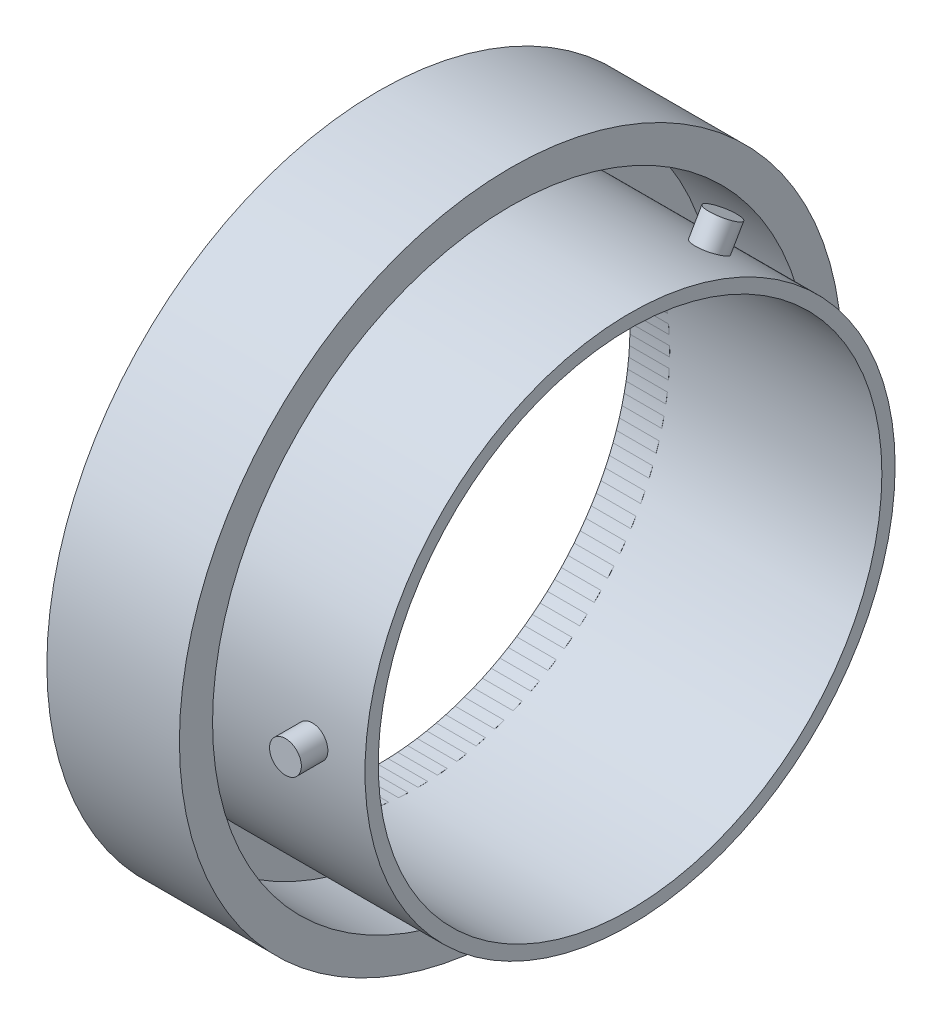
ISO-10303-21;
HEADER;
FILE_DESCRIPTION(('STEP AP214'),'2;1');
FILE_NAME('part.step','',(''),(''),'','','');
FILE_SCHEMA(('AUTOMOTIVE_DESIGN { 1 0 10303 214 1 1 1 1 }'));
ENDSEC;
DATA;
#1=APPLICATION_CONTEXT('core data for automotive mechanical design processes');
#2=APPLICATION_PROTOCOL_DEFINITION('international standard','automotive_design',2000,#1);
#3=PRODUCT_CONTEXT('',#1,'mechanical');
#4=PRODUCT('Part','Part','',(#3));
#5=PRODUCT_RELATED_PRODUCT_CATEGORY('part','',(#4));
#6=PRODUCT_DEFINITION_FORMATION('','',#4);
#7=PRODUCT_DEFINITION_CONTEXT('part definition',#1,'design');
#8=PRODUCT_DEFINITION('design','',#6,#7);
#9=PRODUCT_DEFINITION_SHAPE('','',#8);
#10=(LENGTH_UNIT() NAMED_UNIT(*) SI_UNIT(.MILLI.,.METRE.));
#11=(NAMED_UNIT(*) PLANE_ANGLE_UNIT() SI_UNIT($,.RADIAN.));
#12=(NAMED_UNIT(*) SI_UNIT($,.STERADIAN.) SOLID_ANGLE_UNIT());
#13=UNCERTAINTY_MEASURE_WITH_UNIT(LENGTH_MEASURE(1.E-05),#10,'distance_accuracy_value','');
#14=(GEOMETRIC_REPRESENTATION_CONTEXT(3) GLOBAL_UNCERTAINTY_ASSIGNED_CONTEXT((#13)) GLOBAL_UNIT_ASSIGNED_CONTEXT((#10,
#11,#12)) REPRESENTATION_CONTEXT('',''));
#15=CARTESIAN_POINT('',(0.,0.,0.));
#16=DIRECTION('',(0.,0.,1.));
#17=DIRECTION('',(1.,0.,0.));
#18=AXIS2_PLACEMENT_3D('',#15,#16,#17);
#19=CARTESIAN_POINT('',(20.,0.,0.));
#20=DIRECTION('',(-1.,0.,0.));
#21=DIRECTION('',(0.,0.,1.));
#22=AXIS2_PLACEMENT_3D('',#19,#20,#21);
#23=CYLINDRICAL_SURFACE('',#22,45.);
#24=CARTESIAN_POINT('',(20.,0.,0.));
#25=DIRECTION('',(-1.,0.,0.));
#26=DIRECTION('',(0.,0.,1.));
#27=AXIS2_PLACEMENT_3D('',#24,#25,#26);
#28=CIRCLE('',#27,45.);
#29=CARTESIAN_POINT('',(20.,0.,45.));
#30=VERTEX_POINT('',#29);
#31=EDGE_CURVE('E52',#30,#30,#28,.T.);
#32=ORIENTED_EDGE('',*,*,#31,.F.);
#33=EDGE_LOOP('',(#32));
#34=FACE_BOUND('',#33,.T.);
#35=CARTESIAN_POINT('',(5.99999999999997,0.,0.));
#36=DIRECTION('',(-1.,0.,0.));
#37=DIRECTION('',(0.,0.,1.));
#38=AXIS2_PLACEMENT_3D('',#35,#36,#37);
#39=CIRCLE('',#38,45.);
#40=CARTESIAN_POINT('',(5.99999999999997,0.,45.));
#41=VERTEX_POINT('',#40);
#42=EDGE_CURVE('E11',#41,#41,#39,.F.);
#43=ORIENTED_EDGE('',*,*,#42,.F.);
#44=EDGE_LOOP('',(#43));
#45=FACE_BOUND('',#44,.T.);
#46=ADVANCED_FACE('F42',(#34,#45),#23,.F.);
#47=CARTESIAN_POINT('',(20.,0.,0.));
#48=DIRECTION('',(-1.,0.,0.));
#49=DIRECTION('',(0.,0.,1.));
#50=AXIS2_PLACEMENT_3D('',#47,#48,#49);
#51=CYLINDRICAL_SURFACE('',#50,50.);
#52=CARTESIAN_POINT('',(20.,0.,0.));
#53=DIRECTION('',(-1.,0.,0.));
#54=DIRECTION('',(0.,0.,1.));
#55=AXIS2_PLACEMENT_3D('',#52,#53,#54);
#56=CIRCLE('',#55,50.);
#57=CARTESIAN_POINT('',(20.,0.,50.));
#58=VERTEX_POINT('',#57);
#59=EDGE_CURVE('E48',#58,#58,#56,.T.);
#60=ORIENTED_EDGE('',*,*,#59,.T.);
#61=EDGE_LOOP('',(#60));
#62=FACE_BOUND('',#61,.T.);
#63=CARTESIAN_POINT('',(0.,0.,0.));
#64=DIRECTION('',(-1.,0.,0.));
#65=DIRECTION('',(0.,0.,1.));
#66=AXIS2_PLACEMENT_3D('',#63,#64,#65);
#67=CIRCLE('',#66,50.);
#68=CARTESIAN_POINT('',(0.,0.,50.));
#69=VERTEX_POINT('',#68);
#70=EDGE_CURVE('E57',#69,#69,#67,.T.);
#71=ORIENTED_EDGE('',*,*,#70,.F.);
#72=EDGE_LOOP('',(#71));
#73=FACE_BOUND('',#72,.T.);
#74=ADVANCED_FACE('F87',(#62,#73),#51,.T.);
#75=CARTESIAN_POINT('',(20.,0.,0.));
#76=DIRECTION('',(-1.,0.,0.));
#77=DIRECTION('',(0.,0.,1.));
#78=AXIS2_PLACEMENT_3D('',#75,#76,#77);
#79=PLANE('',#78);
#80=ORIENTED_EDGE('',*,*,#31,.T.);
#81=EDGE_LOOP('',(#80));
#82=FACE_BOUND('',#81,.T.);
#83=ORIENTED_EDGE('',*,*,#59,.F.);
#84=EDGE_LOOP('',(#83));
#85=FACE_BOUND('',#84,.T.);
#86=ADVANCED_FACE('F83',(#82,#85),#79,.F.);
#87=CARTESIAN_POINT('',(0.,0.,0.));
#88=DIRECTION('',(-1.,0.,0.));
#89=DIRECTION('',(0.,0.,1.));
#90=AXIS2_PLACEMENT_3D('',#87,#88,#89);
#91=PLANE('',#90);
#92=ORIENTED_EDGE('',*,*,#70,.T.);
#93=EDGE_LOOP('',(#92));
#94=FACE_BOUND('',#93,.T.);
#95=CARTESIAN_POINT('',(0.,0.,0.));
#96=DIRECTION('',(-1.,0.,0.));
#97=DIRECTION('',(0.,0.,1.));
#98=AXIS2_PLACEMENT_3D('',#95,#96,#97);
#99=CIRCLE('',#98,38.);
#100=CARTESIAN_POINT('',(0.,0.,38.));
#101=VERTEX_POINT('',#100);
#102=EDGE_CURVE('E65',#101,#101,#99,.F.);
#103=ORIENTED_EDGE('',*,*,#102,.T.);
#104=EDGE_LOOP('',(#103));
#105=FACE_BOUND('',#104,.T.);
#106=ADVANCED_FACE('F72',(#94,#105),#91,.T.);
#107=CARTESIAN_POINT('',(5.99999999999997,0.,0.));
#108=DIRECTION('',(-1.,0.,0.));
#109=DIRECTION('',(0.,0.,1.));
#110=AXIS2_PLACEMENT_3D('',#107,#108,#109);
#111=CYLINDRICAL_SURFACE('',#110,38.);
#112=CARTESIAN_POINT('',(5.99999999999997,0.,0.));
#113=DIRECTION('',(-1.,0.,0.));
#114=DIRECTION('',(0.,0.,1.));
#115=AXIS2_PLACEMENT_3D('',#112,#113,#114);
#116=CIRCLE('',#115,38.);
#117=CARTESIAN_POINT('',(5.99999999999997,0.,38.));
#118=VERTEX_POINT('',#117);
#119=EDGE_CURVE('E61',#118,#118,#116,.F.);
#120=ORIENTED_EDGE('',*,*,#119,.T.);
#121=EDGE_LOOP('',(#120));
#122=FACE_BOUND('',#121,.T.);
#123=ORIENTED_EDGE('',*,*,#102,.F.);
#124=EDGE_LOOP('',(#123));
#125=FACE_BOUND('',#124,.T.);
#126=ADVANCED_FACE('F74',(#122,#125),#111,.F.);
#127=CARTESIAN_POINT('',(5.99999999999997,0.,0.));
#128=DIRECTION('',(-1.,0.,0.));
#129=DIRECTION('',(0.,0.,1.));
#130=AXIS2_PLACEMENT_3D('',#127,#128,#129);
#131=PLANE('',#130);
#132=ORIENTED_EDGE('',*,*,#42,.T.);
#133=EDGE_LOOP('',(#132));
#134=FACE_BOUND('',#133,.T.);
#135=ORIENTED_EDGE('',*,*,#119,.F.);
#136=EDGE_LOOP('',(#135));
#137=FACE_BOUND('',#136,.T.);
#138=ADVANCED_FACE('F76',(#134,#137),#131,.F.);
#139=CLOSED_SHELL('',(#46,#74,#86,#106,#126,#138));
#140=MANIFOLD_SOLID_BREP('B2',#139);
#141=CARTESIAN_POINT('',(38.,0.,0.));
#142=DIRECTION('',(-1.,0.,0.));
#143=DIRECTION('',(0.,0.,1.));
#144=AXIS2_PLACEMENT_3D('',#141,#142,#143);
#145=CYLINDRICAL_SURFACE('',#144,40.);
#146=CARTESIAN_POINT('',(38.,0.,0.));
#147=DIRECTION('',(1.,0.,0.));
#148=DIRECTION('',(0.,0.,-1.));
#149=AXIS2_PLACEMENT_3D('',#146,#147,#148);
#150=CIRCLE('',#149,40.);
#151=CARTESIAN_POINT('',(38.,0.,-40.));
#152=VERTEX_POINT('',#151);
#153=EDGE_CURVE('E192',#152,#152,#150,.T.);
#154=ORIENTED_EDGE('',*,*,#153,.F.);
#155=EDGE_LOOP('',(#154));
#156=FACE_BOUND('',#155,.T.);
#157=CARTESIAN_POINT('',(0.,0.,0.));
#158=DIRECTION('',(1.,0.,0.));
#159=DIRECTION('',(0.,0.,-1.));
#160=AXIS2_PLACEMENT_3D('',#157,#158,#159);
#161=CIRCLE('',#160,40.);
#162=CARTESIAN_POINT('',(0.,0.,-40.));
#163=VERTEX_POINT('',#162);
#164=EDGE_CURVE('E146',#163,#163,#161,.T.);
#165=ORIENTED_EDGE('',*,*,#164,.T.);
#166=EDGE_LOOP('',(#165));
#167=FACE_BOUND('',#166,.T.);
#168=CARTESIAN_POINT('',(32.4,0.,40.));
#169=CARTESIAN_POINT('',(32.3999940701088,0.134679058065119,39.9999990415034));
#170=CARTESIAN_POINT('',(32.3886253796701,0.269452680920673,39.9993125316008));
#171=CARTESIAN_POINT('',(32.3434361734883,0.535279278776455,39.9966399072196));
#172=CARTESIAN_POINT('',(32.3095894558053,0.66632772532914,39.9946522761031));
#173=CARTESIAN_POINT('',(32.2204191761859,0.920814929643686,39.9896022881211));
#174=CARTESIAN_POINT('',(32.165106859893,1.04425763281531,39.986540494081));
#175=CARTESIAN_POINT('',(32.0345935231111,1.28007381783377,39.9796866477483));
#176=CARTESIAN_POINT('',(31.9593970879565,1.39244984349884,39.9758947638712));
#177=CARTESIAN_POINT('',(31.791135083404,1.60313164534634,39.9680011357484));
#178=CARTESIAN_POINT('',(31.698047730764,1.70142001165186,39.9638990175052));
#179=CARTESIAN_POINT('',(31.4966909610943,1.88098765510032,39.9558504524011));
#180=CARTESIAN_POINT('',(31.388420913112,1.96226622501112,39.9519040120185));
#181=CARTESIAN_POINT('',(31.1596747547805,2.10555978855846,39.944609000475));
#182=CARTESIAN_POINT('',(31.0391896587135,2.16756046249247,39.941260874526));
#183=CARTESIAN_POINT('',(30.7894965766786,2.27044659614268,39.9355448538501));
#184=CARTESIAN_POINT('',(30.6602886785065,2.31133226834739,39.9331769492589));
#185=CARTESIAN_POINT('',(30.3969842273043,2.3707798650419,39.9296919320214));
#186=CARTESIAN_POINT('',(30.2628938074148,2.38936886399901,39.9285733025158));
#187=CARTESIAN_POINT('',(29.9934915521634,2.40377901056116,39.9277084383936));
#188=CARTESIAN_POINT('',(29.8581797297356,2.39960039898627,39.9279621892608));
#189=CARTESIAN_POINT('',(29.5903600598727,2.36861642347434,39.9298120618954));
#190=CARTESIAN_POINT('',(29.4578488104487,2.34184034754622,39.9314064460915));
#191=CARTESIAN_POINT('',(29.1992051853307,2.26646693710298,39.9357551661515));
#192=CARTESIAN_POINT('',(29.0730728454149,2.21786948021098,39.9385095085205));
#193=CARTESIAN_POINT('',(28.8306733228742,2.1001995188804,39.9448697395931));
#194=CARTESIAN_POINT('',(28.7144126118822,2.03111371400302,39.9484761811445));
#195=CARTESIAN_POINT('',(28.495127320592,1.87443779782635,39.9561336195758));
#196=CARTESIAN_POINT('',(28.3921028770625,1.78684749534723,39.9601846210483));
#197=CARTESIAN_POINT('',(28.2020441902739,1.59548392626235,39.968282361046));
#198=CARTESIAN_POINT('',(28.1150354685979,1.49168530935434,39.9723290827229));
#199=CARTESIAN_POINT('',(27.9596749006336,1.27094049132536,39.9799560546901));
#200=CARTESIAN_POINT('',(27.8913230603991,1.15399428593822,39.9835363048291));
#201=CARTESIAN_POINT('',(27.7752187359883,0.910258604954035,39.9898271357621));
#202=CARTESIAN_POINT('',(27.7274672018875,0.78346867568757,39.992537676444));
#203=CARTESIAN_POINT('',(27.6539359494851,0.523651498534652,39.9967830910968));
#204=CARTESIAN_POINT('',(27.628155994652,0.39062431781059,39.9983179777239));
#205=CARTESIAN_POINT('',(27.5993312864602,0.122330252994027,40.0000374907793));
#206=CARTESIAN_POINT('',(27.5962512438793,-0.0129328268934071,40.0002242130511));
#207=CARTESIAN_POINT('',(27.6128216104686,-0.282053757641071,39.9992319283192));
#208=CARTESIAN_POINT('',(27.6324719107544,-0.415911615229591,39.9980529278576));
#209=CARTESIAN_POINT('',(27.6939159462311,-0.678323069780196,39.9944632874005));
#210=CARTESIAN_POINT('',(27.735693507626,-0.806880467200982,39.9920535470532));
#211=CARTESIAN_POINT('',(27.8401897333114,-1.0551589798001,39.9862735741247));
#212=CARTESIAN_POINT('',(27.902908571278,-1.17488002168416,39.9829033335778));
#213=CARTESIAN_POINT('',(28.0475969380808,-1.40224907825182,39.9755759270369));
#214=CARTESIAN_POINT('',(28.129590054645,-1.50988205922348,39.9716180440943));
#215=CARTESIAN_POINT('',(28.3104651334547,-1.70986838704245,39.9635632409683));
#216=CARTESIAN_POINT('',(28.4093472493186,-1.80222159489331,39.9594663195205));
#217=CARTESIAN_POINT('',(28.6213455812788,-1.96914618916437,39.9515891428078));
#218=CARTESIAN_POINT('',(28.7344798306295,-2.04369469496815,39.9478092990174));
#219=CARTESIAN_POINT('',(28.9716802241726,-2.17273724517006,39.9409990643268));
#220=CARTESIAN_POINT('',(29.0957463052398,-2.22723140536144,39.9379686690994));
#221=CARTESIAN_POINT('',(29.3512047481823,-2.31457869391405,39.9330020336827));
#222=CARTESIAN_POINT('',(29.4825921574617,-2.34744626360747,39.9310650634731));
#223=CARTESIAN_POINT('',(29.7490325575334,-2.3906545607103,39.9285016809601));
#224=CARTESIAN_POINT('',(29.8840855153338,-2.40099549080316,39.9278752568651));
#225=CARTESIAN_POINT('',(30.1537957997511,-2.39885503295942,39.928003893964));
#226=CARTESIAN_POINT('',(30.2884534143966,-2.38640962106737,39.9287567774496));
#227=CARTESIAN_POINT('',(30.5537633994116,-2.33912429993449,39.9315545742254));
#228=CARTESIAN_POINT('',(30.6844157624334,-2.30428434961252,39.9335994898856));
#229=CARTESIAN_POINT('',(30.9380123392336,-2.21320688501306,39.9387503750406));
#230=CARTESIAN_POINT('',(31.0609565801211,-2.15696944599435,39.9418563408034));
#231=CARTESIAN_POINT('',(31.2956623740058,-2.02469853521385,39.9487792363774));
#232=CARTESIAN_POINT('',(31.4074242281586,-1.94866559676817,39.952596147034));
#233=CARTESIAN_POINT('',(31.6167747423957,-1.77882962493749,39.9605177913437));
#234=CARTESIAN_POINT('',(31.7143424059378,-1.68500073008243,39.9646229383309));
#235=CARTESIAN_POINT('',(31.8923745301671,-1.48226827373122,39.9726550178707));
#236=CARTESIAN_POINT('',(31.9728347954863,-1.37336102525148,39.9765819065226));
#237=CARTESIAN_POINT('',(32.1144226512416,-1.14344778901656,39.9838187514897));
#238=CARTESIAN_POINT('',(32.1755273967177,-1.02242772469447,39.9871279769112));
#239=CARTESIAN_POINT('',(32.2764761307353,-0.77191467933783,39.9927465884661));
#240=CARTESIAN_POINT('',(32.3163450655205,-0.64243184147488,39.9950571471539));
#241=CARTESIAN_POINT('',(32.3633074068202,-0.426795112680457,39.9978113565368));
#242=CARTESIAN_POINT('',(32.3770493860136,-0.342035719575557,39.9986284591333));
#243=CARTESIAN_POINT('',(32.3953975653626,-0.171530338784754,39.9997230857829));
#244=CARTESIAN_POINT('',(32.4000037770674,-0.0857843523462168,40.0000006105182));
#245=CARTESIAN_POINT('',(32.4,0.,40.));
#246=B_SPLINE_CURVE_WITH_KNOTS('',3,(#168,#169,#170,#171,#172,#173,#174,#175,#176,#177,#178,
#179,#180,#181,#182,#183,#184,#185,#186,#187,#188,#189,#190,#191,#192,#193,#194,#195,#196,#197,
#198,#199,#200,#201,#202,#203,#204,#205,#206,#207,#208,#209,#210,#211,#212,#213,#214,#215,#216,
#217,#218,#219,#220,#221,#222,#223,#224,#225,#226,#227,#228,#229,#230,#231,#232,#233,#234,#235,
#236,#237,#238,#239,#240,#241,#242,#243,#244,#245),.UNSPECIFIED.,.T.,.F.,(4,2,2,2,2,2,2,2,2,2,2,
2,2,2,2,2,2,2,2,2,2,2,2,2,2,2,2,2,2,2,2,2,2,2,2,2,2,2,4),(0.,0.403724014523295,
0.807919465588716,1.21190344735175,1.61579435038009,2.02018016580109,2.42458279140818,
2.82928509529953,3.23398332643401,3.63818964034752,4.0423916788539,4.44607064430885,
4.8497518736711,5.2536957369178,5.65764377372784,6.06223004537219,6.46681644829858,
6.8714215085508,7.27602221303742,7.67999379342517,8.0839634386895,8.48763821131356,
8.89131633189325,9.29549106673023,9.6996694780461,10.1043645327752,10.5090572507695,
10.9134794569104,11.3178980242473,11.7216786289015,12.125459974264,12.5292398994684,
12.9330089474496,13.3373693206883,13.7418287439858,14.1467637796536,14.5512220728811,
14.8083759867313,15.065529575493),.UNSPECIFIED.);
#247=CARTESIAN_POINT('',(32.4,0.,40.));
#248=VERTEX_POINT('',#247);
#249=EDGE_CURVE('E155',#248,#248,#246,.T.);
#250=ORIENTED_EDGE('',*,*,#249,.F.);
#251=EDGE_LOOP('',(#250));
#252=FACE_BOUND('',#251,.T.);
#253=CARTESIAN_POINT('',(30.,33.378606102618,-22.0424285106308));
#254=CARTESIAN_POINT('',(29.8653211879936,33.3786099033497,-22.042423857478));
#255=CARTESIAN_POINT('',(29.7305478103677,33.3848898626657,-22.0329222070541));
#256=CARTESIAN_POINT('',(29.4647217220613,33.4098028664997,-21.9951259366489));
#257=CARTESIAN_POINT('',(29.3336735400203,33.4284503279173,-21.9668093839092));
#258=CARTESIAN_POINT('',(29.0791868948612,33.4774148324509,-21.8921145330572));
#259=CARTESIAN_POINT('',(28.9557444840928,33.5077257616237,-21.8457456977298));
#260=CARTESIAN_POINT('',(28.7199287883957,33.5789233816887,-21.7361485558934));
#261=CARTESIAN_POINT('',(28.6075529600184,33.6198076346291,-21.6729241357696));
#262=CARTESIAN_POINT('',(28.3968709328814,33.7107772579984,-21.5311536575992));
#263=CARTESIAN_POINT('',(28.298582207088,33.7608738822407,-21.4525888524355));
#264=CARTESIAN_POINT('',(28.1190138705434,33.8685212689755,-21.2822319790126));
#265=CARTESIAN_POINT('',(28.0377349659227,33.9260723407647,-21.1904393618926));
#266=CARTESIAN_POINT('',(27.8944410543302,34.0467582321341,-20.9959838556029));
#267=CARTESIAN_POINT('',(27.8324403050409,34.1098971402271,-20.8933129960175));
#268=CARTESIAN_POINT('',(27.7295540128949,34.2396875070648,-20.6799269372206));
#269=CARTESIAN_POINT('',(27.6886682584599,34.3063389306057,-20.5692118186276));
#270=CARTESIAN_POINT('',(27.6292204870279,34.4410042540049,-20.3429233628261));
#271=CARTESIAN_POINT('',(27.6106313893658,34.5090163988491,-20.2273560958728));
#272=CARTESIAN_POINT('',(27.5962209905085,34.6444650389375,-19.9944788328552));
#273=CARTESIAN_POINT('',(27.6003994495393,34.7119015402366,-19.877168855157));
#274=CARTESIAN_POINT('',(27.631383185668,34.8442124966411,-19.6443063210564));
#275=CARTESIAN_POINT('',(27.6581593282527,34.9090901381258,-19.5287516967194));
#276=CARTESIAN_POINT('',(27.7335331541392,35.0346523392831,-19.3025872997175));
#277=CARTESIAN_POINT('',(27.7821309583291,35.0953368757244,-19.1919775544502));
#278=CARTESIAN_POINT('',(27.8998016343516,35.2110350850668,-18.9788760086976));
#279=CARTESIAN_POINT('',(27.9688877248634,35.266045065867,-18.876389503447));
#280=CARTESIAN_POINT('',(28.1255642483169,35.3690601611445,-18.6826561390906));
#281=CARTESIAN_POINT('',(28.2131548726115,35.4170652031762,-18.5914093962291));
#282=CARTESIAN_POINT('',(28.4045186673484,35.5050814285702,-18.4227651486132));
#283=CARTESIAN_POINT('',(28.5083171230637,35.54507989482,-18.3453896961264));
#284=CARTESIAN_POINT('',(28.7290614837656,35.616150689275,-18.2070283056306));
#285=CARTESIAN_POINT('',(28.8460073935598,35.6472230142163,-18.1460423736148));
#286=CARTESIAN_POINT('',(29.0897430000638,35.6998208676485,-18.0423442900794));
#287=CARTESIAN_POINT('',(29.2165331968199,35.7213459108064,-17.9996330675526));
#288=CARTESIAN_POINT('',(29.4763509545513,35.7544292097708,-17.9338272576043));
#289=CARTESIAN_POINT('',(29.6093784479127,35.7659875735926,-17.9107324575873));
#290=CARTESIAN_POINT('',(29.8776726492306,35.7789080113469,-17.884908558137));
#291=CARTESIAN_POINT('',(30.0129355438306,35.7802859497583,-17.8821477715883));
#292=CARTESIAN_POINT('',(30.2820560648665,35.772861532127,-17.8969953912287));
#293=CARTESIAN_POINT('',(30.41591369803,35.7640592248449,-17.9146036998554));
#294=CARTESIAN_POINT('',(30.6783240814284,35.7364509633049,-17.9696134833263));
#295=CARTESIAN_POINT('',(30.8068806547282,35.7176523592063,-18.0070004150782));
#296=CARTESIAN_POINT('',(31.0551576196156,35.6704164868205,-18.1003897766546));
#297=CARTESIAN_POINT('',(31.1748779373488,35.6419791379828,-18.156392362049));
#298=CARTESIAN_POINT('',(31.4022465143161,35.5759858563857,-18.2853620142118));
#299=CARTESIAN_POINT('',(31.5098796585573,35.5384186884291,-18.3583499785329));
#300=CARTESIAN_POINT('',(31.7098663631075,35.4549581296714,-18.5190204263251));
#301=CARTESIAN_POINT('',(31.8022197851191,35.4090646635165,-18.6067030427836));
#302=CARTESIAN_POINT('',(31.9691448225321,35.3098844149854,-18.7942359988454));
#303=CARTESIAN_POINT('',(32.043693556075,35.2565882565375,-18.8941017494797));
#304=CARTESIAN_POINT('',(32.1727365062677,35.1438800070951,-19.102925348277));
#305=CARTESIAN_POINT('',(32.2272308387306,35.0844679514222,-19.2118831439294));
#306=CARTESIAN_POINT('',(32.3145782456187,34.9610339066286,-19.4355963273031));
#307=CARTESIAN_POINT('',(32.3474458359113,34.8970150416801,-19.550347770514));
#308=CARTESIAN_POINT('',(32.390654279956,34.7660113409533,-19.7823708644015));
#309=CARTESIAN_POINT('',(32.4009953347385,34.699026531649,-19.8996424925783));
#310=CARTESIAN_POINT('',(32.3988552322548,34.5640600903626,-20.1331544573429));
#311=CARTESIAN_POINT('',(32.3864099022954,34.4960801896643,-20.2493961246334));
#312=CARTESIAN_POINT('',(32.339124543215,34.361005741394,-20.4777657834058));
#313=CARTESIAN_POINT('',(32.3042844740374,34.2939111954058,-20.5898937675294));
#314=CARTESIAN_POINT('',(32.2132065573973,34.1626577031595,-20.8069439696201));
#315=CARTESIAN_POINT('',(32.1569687841068,34.0984987467265,-20.9118662125634));
#316=CARTESIAN_POINT('',(32.0246970305132,33.9751555065503,-21.1116700095793));
#317=CARTESIAN_POINT('',(31.94866358414,33.9159710886905,-21.2065518343654));
#318=CARTESIAN_POINT('',(31.7788270629948,33.8044380442315,-21.3838952982275));
#319=CARTESIAN_POINT('',(31.684998242247,33.7520995098231,-21.4663386273477));
#320=CARTESIAN_POINT('',(31.4822660887133,33.6561262295901,-21.6165013751128));
#321=CARTESIAN_POINT('',(31.3733590681183,33.6124936194433,-21.6842171812683));
#322=CARTESIAN_POINT('',(31.1434460080383,33.5354275139364,-21.8032141927756));
#323=CARTESIAN_POINT('',(31.0224258513503,33.5020061073288,-21.8544759222171));
#324=CARTESIAN_POINT('',(30.7719126082327,33.4466596592218,-21.9390869857176));
#325=CARTESIAN_POINT('',(30.6424296655048,33.4247211283539,-21.9724573385803));
#326=CARTESIAN_POINT('',(30.4267931947713,33.3988509785172,-22.0117483209367));
#327=CARTESIAN_POINT('',(30.3420341842103,33.3912711945965,-22.0232398574009));
#328=CARTESIAN_POINT('',(30.1715295702764,33.3811475494075,-22.0385814293062));
#329=CARTESIAN_POINT('',(30.0857839681585,33.3786036817336,-22.0424314744668));
#330=CARTESIAN_POINT('',(30.,33.378606102618,-22.0424285106308));
#331=B_SPLINE_CURVE_WITH_KNOTS('',3,(#253,#254,#255,#256,#257,#258,#259,#260,#261,#262,#263,
#264,#265,#266,#267,#268,#269,#270,#271,#272,#273,#274,#275,#276,#277,#278,#279,#280,#281,#282,
#283,#284,#285,#286,#287,#288,#289,#290,#291,#292,#293,#294,#295,#296,#297,#298,#299,#300,#301,
#302,#303,#304,#305,#306,#307,#308,#309,#310,#311,#312,#313,#314,#315,#316,#317,#318,#319,#320,
#321,#322,#323,#324,#325,#326,#327,#328,#329,#330),.UNSPECIFIED.,.T.,.F.,(4,2,2,2,2,2,2,2,2,2,2,
2,2,2,2,2,2,2,2,2,2,2,2,2,2,2,2,2,2,2,2,2,2,2,2,2,2,2,4),(0.,0.403723275528664,0.80791800375262,
1.211901142719,1.61579121589949,2.0201779980989,2.42458156432626,2.82928351066153,
3.23398140168884,3.63818726281857,4.04238886710699,4.44607014113407,4.84975365151248,
5.25369818006367,5.65764688595333,6.06223219305672,6.46681764810357,6.87142366776348,
7.27602530239688,7.67999630025942,8.08396536322178,8.48763780238125,8.8913136150938,
9.29548873118799,9.69966750528602,10.1043629515416,10.5090560606631,10.9134772619691,
11.3178948541408,11.7216771216469,12.1254601113845,12.5292417014805,12.9330124018876,
13.3373717881661,13.741830247495,14.1467656946734,14.5512243751357,14.8083771384257,
15.0655295746319),.UNSPECIFIED.);
#332=CARTESIAN_POINT('',(30.,33.378606102618,-22.0424285106308));
#333=VERTEX_POINT('',#332);
#334=EDGE_CURVE('E150',#333,#333,#331,.T.);
#335=ORIENTED_EDGE('',*,*,#334,.F.);
#336=EDGE_LOOP('',(#335));
#337=FACE_BOUND('',#336,.T.);
#338=CARTESIAN_POINT('',(30.,-35.7786061026178,-17.885506572466));
#339=CARTESIAN_POINT('',(29.8653211879936,-35.7786039732351,-17.8855121905725));
#340=CARTESIAN_POINT('',(29.7305478103677,-35.7735152822481,-17.8957016200868));
#341=CARTESIAN_POINT('',(29.4647217220613,-35.7532392538259,-17.9361750494943));
#342=CARTESIAN_POINT('',(29.3336735400203,-35.7380401305145,-17.9664825011679));
#343=CARTESIAN_POINT('',(29.0791868948612,-35.6978347444116,-18.0462344314037));
#344=CARTESIAN_POINT('',(28.9557444840928,-35.6728336196605,-18.0956688837433));
#345=CARTESIAN_POINT('',(28.7199287883957,-35.6135185206806,-18.2121264023268));
#346=CARTESIAN_POINT('',(28.6075529600184,-35.579206693184,-18.2791454140499));
#347=CARTESIAN_POINT('',(28.3968709328814,-35.5019146692665,-18.4288126579456));
#348=CARTESIAN_POINT('',(28.298582207088,-35.4589238642725,-18.5114800097651));
#349=CARTESIAN_POINT('',(28.1190138705434,-35.3652141775463,-18.6898838180399));
#350=CARTESIAN_POINT('',(28.0377349659227,-35.3144949751352,-18.7856208167844));
#351=CARTESIAN_POINT('',(27.8944410543302,-35.2064345124672,-18.9873656177334));
#352=CARTESIAN_POINT('',(27.8324403050409,-35.1490883938843,-19.0933809459019));
#353=CARTESIAN_POINT('',(27.7295540128949,-35.0291858295717,-19.3124757301483));
#354=CARTESIAN_POINT('',(27.6886682584599,-34.9666294360576,-19.4255551154297));
#355=CARTESIAN_POINT('',(27.6292204870279,-34.8379905464499,-19.6553229344029));
#356=CARTESIAN_POINT('',(27.6106313893658,-34.7719124298445,-19.7720068130805));
#357=CARTESIAN_POINT('',(27.5962209905085,-34.6379591241517,-20.005747407814));
#358=CARTESIAN_POINT('',(27.6003994495393,-34.5700839539972,-20.1228041199304));
#359=CARTESIAN_POINT('',(27.631383185668,-34.4345745620787,-20.353820036426));
#360=CARTESIAN_POINT('',(27.6581593282527,-34.3669401426204,-20.4677830342579));
#361=CARTESIAN_POINT('',(27.7335331541392,-34.2338571299639,-20.6896052887161));
#362=CARTESIAN_POINT('',(27.7821309583291,-34.1684085488769,-20.7974645115248));
#363=CARTESIAN_POINT('',(27.8998016343516,-34.0417063013406,-21.0042128728641));
#364=CARTESIAN_POINT('',(27.9688877248634,-33.9804553746486,-21.103096166324));
#365=CARTESIAN_POINT('',(28.1255642483169,-33.8641849071941,-21.2891765379858));
#366=CARTESIAN_POINT('',(28.2131548726115,-33.8091654308793,-21.3763734953257));
#367=CARTESIAN_POINT('',(28.4045186673484,-33.7071233409388,-21.5369199062701));
#368=CARTESIAN_POINT('',(28.5083171230637,-33.6601134665808,-21.6102473203982));
#369=CARTESIAN_POINT('',(28.7290614837656,-33.5758243847361,-21.7409771291113));
#370=CARTESIAN_POINT('',(28.8460073935598,-33.5385451808075,-21.798379517873));
#371=CARTESIAN_POINT('',(29.0897430000638,-33.4750389328582,-21.8957796368975));
#372=CARTESIAN_POINT('',(29.2165331968199,-33.4488124507022,-21.9357764823533));
#373=CARTESIAN_POINT('',(29.4763509545513,-33.4083645970527,-21.9973303646716));
#374=CARTESIAN_POINT('',(29.6093784479127,-33.3941430954535,-22.0188876013759));
#375=CARTESIAN_POINT('',(29.8776726492306,-33.3782391613819,-22.0429889784243));
#376=CARTESIAN_POINT('',(30.0129355438306,-33.376537219302,-22.0455627013678));
#377=CARTESIAN_POINT('',(30.2820560648665,-33.3856834262807,-22.0317091572706));
#378=CARTESIAN_POINT('',(30.41591369803,-33.3965315152281,-22.0152819812391));
#379=CARTESIAN_POINT('',(30.6783240814284,-33.4303672544006,-21.9638676336556));
#380=CARTESIAN_POINT('',(30.8068806547282,-33.4533459850179,-21.9288940990745));
#381=CARTESIAN_POINT('',(31.0551576196156,-33.5106056083933,-21.8412919528304));
#382=CARTESIAN_POINT('',(31.1748779373488,-33.5448865956037,-21.7886631936234));
#383=CARTESIAN_POINT('',(31.4022465143161,-33.6235809498953,-21.6670265091998));
#384=CARTESIAN_POINT('',(31.5098796585573,-33.6680067971896,-21.5979984052406));
#385=CARTESIAN_POINT('',(31.7098663631075,-33.7654212072362,-21.4453842172463));
#386=CARTESIAN_POINT('',(31.8022197851191,-33.8184098474821,-21.3617980014592));
#387=CARTESIAN_POINT('',(31.9691448225322,-33.9312280272129,-21.1821389086467));
#388=CARTESIAN_POINT('',(32.043693556075,-33.9910662250063,-21.0860502061895));
#389=CARTESIAN_POINT('',(32.1727365062677,-34.1155586417532,-20.8840301995578));
#390=CARTESIAN_POINT('',(32.2272308387306,-34.1802128328921,-20.7780989522278));
#391=CARTESIAN_POINT('',(32.3145782456187,-34.3122371104584,-20.5593453420577));
#392=CARTESIAN_POINT('',(32.3474458359113,-34.3796053429257,-20.4465276570855));
#393=CARTESIAN_POINT('',(32.390654279956,-34.5150413861336,-20.2170635773226));
#394=CARTESIAN_POINT('',(32.4009953347385,-34.5831091906257,-20.100417216709));
#395=CARTESIAN_POINT('',(32.3988552322548,-34.7178532635562,-19.8667768675143));
#396=CARTESIAN_POINT('',(32.3864099022954,-34.784531550059,-19.7497837129176));
#397=CARTESIAN_POINT('',(32.339124543215,-34.9147682518743,-19.5186209799271));
#398=CARTESIAN_POINT('',(32.3042844740374,-34.9783266616063,-19.4044514065842));
#399=CARTESIAN_POINT('',(32.2132065573973,-35.1006709043903,-19.1822574469181));
#400=CARTESIAN_POINT('',(32.1569687841068,-35.1594567539847,-19.0742330392951));
#401=CARTESIAN_POINT('',(32.0246970305132,-35.270820297885,-18.8675127614095));
#402=CARTESIAN_POINT('',(31.94866358414,-35.3233981595773,-18.7688166396417));
#403=CARTESIAN_POINT('',(31.7788270629948,-35.4212155822475,-18.5835544578477));
#404=CARTESIAN_POINT('',(31.684998242247,-35.4664443324339,-18.4970062928931));
#405=CARTESIAN_POINT('',(31.4822660887133,-35.5485024465841,-18.3388096202442));
#406=CARTESIAN_POINT('',(31.3733590681183,-35.5853297498791,-18.267164768346));
#407=CARTESIAN_POINT('',(31.1434460080383,-35.6498511320654,-18.1409250574526));
#408=CARTESIAN_POINT('',(31.0224258513503,-35.6775343886998,-18.0863504055794));
#409=CARTESIAN_POINT('',(30.7719126082327,-35.723136495079,-17.9961134437592));
#410=CARTESIAN_POINT('',(30.6424296655048,-35.7410668029574,-17.9604289422747));
#411=CARTESIAN_POINT('',(30.4267931947713,-35.7621587168993,-17.9183792441381));
#412=CARTESIAN_POINT('',(30.3420341842103,-35.7683207874455,-17.9060691904756));
#413=CARTESIAN_POINT('',(30.1715295702764,-35.7765451558549,-17.8896310706103));
#414=CARTESIAN_POINT('',(30.0857839681585,-35.7786074589328,-17.8855029940005));
#415=CARTESIAN_POINT('',(30.,-35.7786061026178,-17.885506572466));
#416=B_SPLINE_CURVE_WITH_KNOTS('',3,(#338,#339,#340,#341,#342,#343,#344,#345,#346,#347,#348,
#349,#350,#351,#352,#353,#354,#355,#356,#357,#358,#359,#360,#361,#362,#363,#364,#365,#366,#367,
#368,#369,#370,#371,#372,#373,#374,#375,#376,#377,#378,#379,#380,#381,#382,#383,#384,#385,#386,
#387,#388,#389,#390,#391,#392,#393,#394,#395,#396,#397,#398,#399,#400,#401,#402,#403,#404,#405,
#406,#407,#408,#409,#410,#411,#412,#413,#414,#415),.UNSPECIFIED.,.T.,.F.,(4,2,2,2,2,2,2,2,2,2,2,
2,2,2,2,2,2,2,2,2,2,2,2,2,2,2,2,2,2,2,2,2,2,2,2,2,2,2,4),(0.,0.403723275528667,
0.807918003752621,1.21190114271899,1.61579121589949,2.02017799809889,2.42458156432625,
2.82928351066154,3.23398140168885,3.63818726281857,4.04238886710699,4.44607014113407,
4.84975365151249,5.25369818006367,5.65764688595333,6.06223219305672,6.46681764810358,
6.87142366776348,7.27602530239688,7.67999630025943,8.08396536322179,8.48763780238125,
8.8913136150938,9.295488731188,9.69966750528603,10.1043629515416,10.5090560606631,
10.9134772619691,11.3178948541408,11.7216771216469,12.1254601113846,12.5292417014805,
12.9330124018876,13.3373717881661,13.741830247495,14.1467656946734,14.5512243751358,
14.8083771384257,15.0655295746319),.UNSPECIFIED.);
#417=CARTESIAN_POINT('',(30.,-35.7786061026178,-17.885506572466));
#418=VERTEX_POINT('',#417);
#419=EDGE_CURVE('E41',#418,#418,#416,.T.);
#420=ORIENTED_EDGE('',*,*,#419,.F.);
#421=EDGE_LOOP('',(#420));
#422=FACE_BOUND('',#421,.T.);
#423=ADVANCED_FACE('F142',(#156,#167,#252,#337,#422),#145,.T.);
#424=CARTESIAN_POINT('',(38.,0.,0.));
#425=DIRECTION('',(-1.,0.,0.));
#426=DIRECTION('',(0.,0.,1.));
#427=AXIS2_PLACEMENT_3D('',#424,#425,#426);
#428=CYLINDRICAL_SURFACE('',#427,38.);
#429=CARTESIAN_POINT('',(0.,0.,0.));
#430=DIRECTION('',(1.,0.,0.));
#431=DIRECTION('',(0.,0.,-1.));
#432=AXIS2_PLACEMENT_3D('',#429,#430,#431);
#433=CIRCLE('',#432,38.);
#434=CARTESIAN_POINT('',(0.,0.,-38.));
#435=VERTEX_POINT('',#434);
#436=EDGE_CURVE('E196',#435,#435,#433,.T.);
#437=ORIENTED_EDGE('',*,*,#436,.F.);
#438=EDGE_LOOP('',(#437));
#439=FACE_BOUND('',#438,.T.);
#440=CARTESIAN_POINT('',(38.,0.,0.));
#441=DIRECTION('',(1.,0.,0.));
#442=DIRECTION('',(0.,0.,-1.));
#443=AXIS2_PLACEMENT_3D('',#440,#441,#442);
#444=CIRCLE('',#443,38.);
#445=CARTESIAN_POINT('',(38.,0.,-38.));
#446=VERTEX_POINT('',#445);
#447=EDGE_CURVE('E193',#446,#446,#444,.T.);
#448=ORIENTED_EDGE('',*,*,#447,.T.);
#449=EDGE_LOOP('',(#448));
#450=FACE_BOUND('',#449,.T.);
#451=ADVANCED_FACE('F186',(#439,#450),#428,.F.);
#452=CARTESIAN_POINT('',(38.,0.,0.));
#453=DIRECTION('',(1.,0.,0.));
#454=DIRECTION('',(0.,0.,-1.));
#455=AXIS2_PLACEMENT_3D('',#452,#453,#454);
#456=PLANE('',#455);
#457=ORIENTED_EDGE('',*,*,#153,.T.);
#458=EDGE_LOOP('',(#457));
#459=FACE_BOUND('',#458,.T.);
#460=ORIENTED_EDGE('',*,*,#447,.F.);
#461=EDGE_LOOP('',(#460));
#462=FACE_BOUND('',#461,.T.);
#463=ADVANCED_FACE('F208',(#459,#462),#456,.T.);
#464=CARTESIAN_POINT('',(0.,0.,0.));
#465=DIRECTION('',(1.,0.,0.));
#466=DIRECTION('',(0.,0.,-1.));
#467=AXIS2_PLACEMENT_3D('',#464,#465,#466);
#468=PLANE('',#467);
#469=ORIENTED_EDGE('',*,*,#164,.F.);
#470=EDGE_LOOP('',(#469));
#471=FACE_BOUND('',#470,.T.);
#472=ORIENTED_EDGE('',*,*,#436,.T.);
#473=EDGE_LOOP('',(#472));
#474=FACE_BOUND('',#473,.T.);
#475=ADVANCED_FACE('F184',(#471,#474),#468,.F.);
#476=CARTESIAN_POINT('',(30.,0.,44.));
#477=DIRECTION('',(0.,0.,-1.));
#478=DIRECTION('',(-1.,0.,0.));
#479=AXIS2_PLACEMENT_3D('',#476,#477,#478);
#480=CYLINDRICAL_SURFACE('',#479,2.4);
#481=CARTESIAN_POINT('',(30.,0.,44.));
#482=DIRECTION('',(0.,0.,1.));
#483=DIRECTION('',(1.,0.,0.));
#484=AXIS2_PLACEMENT_3D('',#481,#482,#483);
#485=CIRCLE('',#484,2.4);
#486=CARTESIAN_POINT('',(32.4,0.,44.));
#487=VERTEX_POINT('',#486);
#488=EDGE_CURVE('E165',#487,#487,#485,.T.);
#489=ORIENTED_EDGE('',*,*,#488,.F.);
#490=EDGE_LOOP('',(#489));
#491=FACE_BOUND('',#490,.T.);
#492=ORIENTED_EDGE('',*,*,#249,.T.);
#493=EDGE_LOOP('',(#492));
#494=FACE_BOUND('',#493,.T.);
#495=ADVANCED_FACE('F179',(#491,#494),#480,.T.);
#496=CARTESIAN_POINT('',(30.,0.,44.));
#497=DIRECTION('',(0.,0.,1.));
#498=DIRECTION('',(1.,0.,0.));
#499=AXIS2_PLACEMENT_3D('',#496,#497,#498);
#500=PLANE('',#499);
#501=ORIENTED_EDGE('',*,*,#488,.T.);
#502=EDGE_LOOP('',(#501));
#503=FACE_BOUND('',#502,.T.);
#504=ADVANCED_FACE('F175',(#503),#500,.T.);
#505=CARTESIAN_POINT('',(30.,38.1051177665155,-21.9999999999997));
#506=DIRECTION('',(0.,0.866025403784443,-0.499999999999992));
#507=DIRECTION('',(1.,0.,0.));
#508=AXIS2_PLACEMENT_3D('',#505,#506,#507);
#509=PLANE('',#508);
#510=CARTESIAN_POINT('',(30.,38.1051177665155,-21.9999999999997));
#511=DIRECTION('',(0.,0.866025403784443,-0.499999999999992));
#512=DIRECTION('',(1.,0.,0.));
#513=AXIS2_PLACEMENT_3D('',#510,#511,#512);
#514=CIRCLE('',#513,2.4);
#515=CARTESIAN_POINT('',(32.4,38.1051177665155,-21.9999999999997));
#516=VERTEX_POINT('',#515);
#517=EDGE_CURVE('E291',#516,#516,#514,.T.);
#518=ORIENTED_EDGE('',*,*,#517,.T.);
#519=EDGE_LOOP('',(#518));
#520=FACE_BOUND('',#519,.T.);
#521=ADVANCED_FACE('F178',(#520),#509,.T.);
#522=CARTESIAN_POINT('',(30.,38.1051177665155,-21.9999999999997));
#523=DIRECTION('',(0.,-0.866025403784443,0.499999999999992));
#524=DIRECTION('',(0.,-0.499999999999992,-0.866025403784443));
#525=AXIS2_PLACEMENT_3D('',#522,#523,#524);
#526=CYLINDRICAL_SURFACE('',#525,2.4);
#527=ORIENTED_EDGE('',*,*,#517,.F.);
#528=EDGE_LOOP('',(#527));
#529=FACE_BOUND('',#528,.T.);
#530=ORIENTED_EDGE('',*,*,#334,.T.);
#531=EDGE_LOOP('',(#530));
#532=FACE_BOUND('',#531,.T.);
#533=ADVANCED_FACE('F173',(#529,#532),#526,.T.);
#534=CARTESIAN_POINT('',(30.,-38.1051177665152,-22.0000000000002));
#535=DIRECTION('',(0.,0.866025403784436,0.500000000000004));
#536=DIRECTION('',(0.,-0.500000000000004,0.866025403784436));
#537=AXIS2_PLACEMENT_3D('',#534,#535,#536);
#538=CYLINDRICAL_SURFACE('',#537,2.4);
#539=CARTESIAN_POINT('',(30.,-38.1051177665152,-22.0000000000002));
#540=DIRECTION('',(0.,-0.866025403784436,-0.500000000000004));
#541=DIRECTION('',(1.,0.,0.));
#542=AXIS2_PLACEMENT_3D('',#539,#540,#541);
#543=CIRCLE('',#542,2.4);
#544=CARTESIAN_POINT('',(32.4,-38.1051177665152,-22.0000000000002));
#545=VERTEX_POINT('',#544);
#546=EDGE_CURVE('E292',#545,#545,#543,.T.);
#547=ORIENTED_EDGE('',*,*,#546,.F.);
#548=EDGE_LOOP('',(#547));
#549=FACE_BOUND('',#548,.T.);
#550=ORIENTED_EDGE('',*,*,#419,.T.);
#551=EDGE_LOOP('',(#550));
#552=FACE_BOUND('',#551,.T.);
#553=ADVANCED_FACE('F167',(#549,#552),#538,.T.);
#554=CARTESIAN_POINT('',(30.,-38.1051177665152,-22.0000000000002));
#555=DIRECTION('',(0.,-0.866025403784436,-0.500000000000004));
#556=DIRECTION('',(1.,0.,0.));
#557=AXIS2_PLACEMENT_3D('',#554,#555,#556);
#558=PLANE('',#557);
#559=ORIENTED_EDGE('',*,*,#546,.T.);
#560=EDGE_LOOP('',(#559));
#561=FACE_BOUND('',#560,.T.);
#562=ADVANCED_FACE('F172',(#561),#558,.T.);
#563=CLOSED_SHELL('',(#423,#451,#463,#475,#495,#504,#521,#533,#553,#562));
#564=MANIFOLD_SOLID_BREP('B6',#563);
#565=ADVANCED_BREP_SHAPE_REPRESENTATION('',(#18,#140,#564),#14);
#566=SHAPE_DEFINITION_REPRESENTATION(#9,#565);
ENDSEC;
END-ISO-10303-21;
